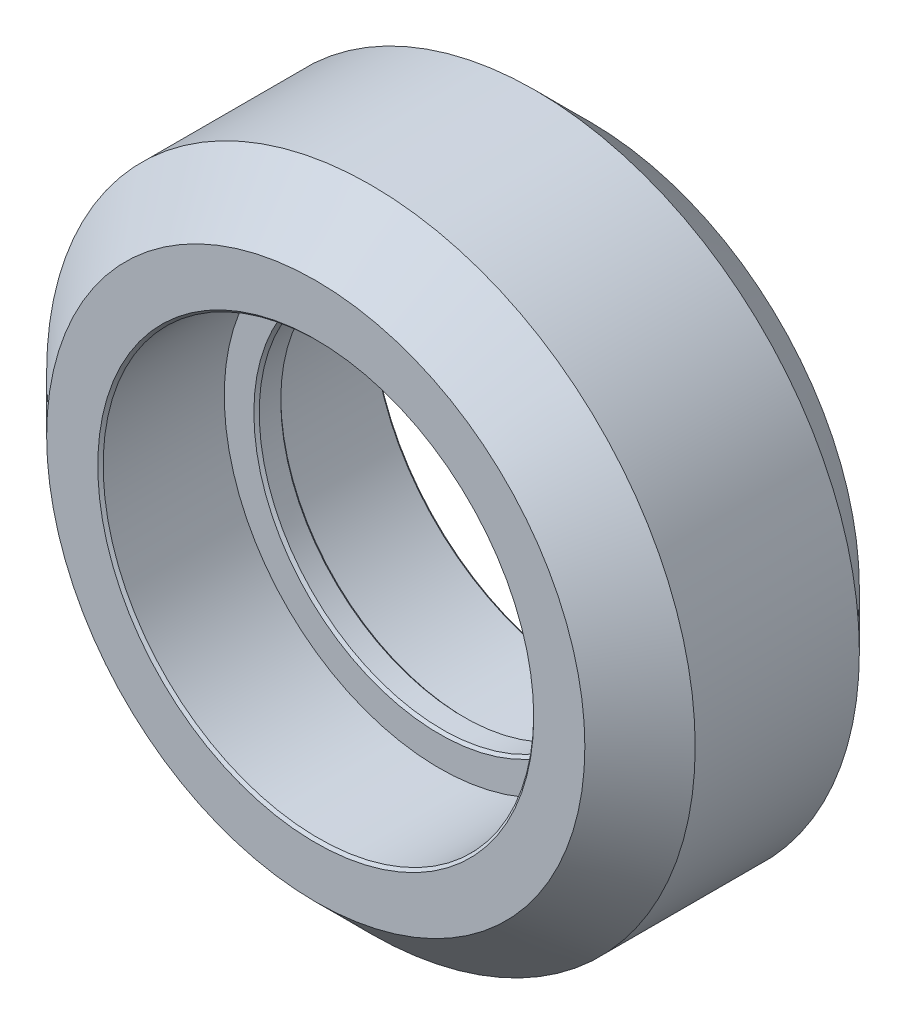
ISO-10303-21;
HEADER;
FILE_DESCRIPTION(('STEP AP214'),'2;1');
FILE_NAME('part.step','',(''),(''),'','','');
FILE_SCHEMA(('AUTOMOTIVE_DESIGN { 1 0 10303 214 1 1 1 1 }'));
ENDSEC;
DATA;
#1=APPLICATION_CONTEXT('core data for automotive mechanical design processes');
#2=APPLICATION_PROTOCOL_DEFINITION('international standard','automotive_design',2000,#1);
#3=PRODUCT_CONTEXT('',#1,'mechanical');
#4=PRODUCT('Part','Part','',(#3));
#5=PRODUCT_RELATED_PRODUCT_CATEGORY('part','',(#4));
#6=PRODUCT_DEFINITION_FORMATION('','',#4);
#7=PRODUCT_DEFINITION_CONTEXT('part definition',#1,'design');
#8=PRODUCT_DEFINITION('design','',#6,#7);
#9=PRODUCT_DEFINITION_SHAPE('','',#8);
#10=(LENGTH_UNIT() NAMED_UNIT(*) SI_UNIT(.MILLI.,.METRE.));
#11=(NAMED_UNIT(*) PLANE_ANGLE_UNIT() SI_UNIT($,.RADIAN.));
#12=(NAMED_UNIT(*) SI_UNIT($,.STERADIAN.) SOLID_ANGLE_UNIT());
#13=UNCERTAINTY_MEASURE_WITH_UNIT(LENGTH_MEASURE(1.E-05),#10,'distance_accuracy_value','');
#14=(GEOMETRIC_REPRESENTATION_CONTEXT(3) GLOBAL_UNCERTAINTY_ASSIGNED_CONTEXT((#13)) GLOBAL_UNIT_ASSIGNED_CONTEXT((#10,
#11,#12)) REPRESENTATION_CONTEXT('',''));
#15=CARTESIAN_POINT('',(0.,0.,0.));
#16=DIRECTION('',(0.,0.,1.));
#17=DIRECTION('',(1.,0.,0.));
#18=AXIS2_PLACEMENT_3D('',#15,#16,#17);
#19=CARTESIAN_POINT('',(15.5,-35.5,-38.35));
#20=DIRECTION('',(0.,0.,1.));
#21=DIRECTION('',(1.,0.,0.));
#22=AXIS2_PLACEMENT_3D('',#19,#20,#21);
#23=CYLINDRICAL_SURFACE('',#22,6.8);
#24=CARTESIAN_POINT('',(15.5,-35.5,-13.8499999999908));
#25=DIRECTION('',(0.,0.,-1.));
#26=DIRECTION('',(-1.,0.,0.));
#27=AXIS2_PLACEMENT_3D('',#24,#25,#26);
#28=CIRCLE('',#27,6.79999999991014);
#29=CARTESIAN_POINT('',(8.70000000008986,-35.5,-13.8499999999908));
#30=VERTEX_POINT('',#29);
#31=EDGE_CURVE('E40',#30,#30,#28,.T.);
#32=ORIENTED_EDGE('',*,*,#31,.T.);
#33=EDGE_LOOP('',(#32));
#34=FACE_BOUND('',#33,.T.);
#35=CARTESIAN_POINT('',(15.5,-35.5,-13.0500000000211));
#36=DIRECTION('',(0.,0.,1.));
#37=DIRECTION('',(1.,0.,0.));
#38=AXIS2_PLACEMENT_3D('',#35,#36,#37);
#39=CIRCLE('',#38,6.7999999999729);
#40=CARTESIAN_POINT('',(22.2999999999729,-35.5,-13.0500000000211));
#41=VERTEX_POINT('',#40);
#42=EDGE_CURVE('E37',#41,#41,#39,.T.);
#43=ORIENTED_EDGE('',*,*,#42,.T.);
#44=EDGE_LOOP('',(#43));
#45=FACE_BOUND('',#44,.T.);
#46=ADVANCED_FACE('F14',(#34,#45),#23,.F.);
#47=CARTESIAN_POINT('',(15.5,-35.5,-13.9499999999089));
#48=DIRECTION('',(0.,0.,-1.));
#49=DIRECTION('',(-1.,0.,0.));
#50=AXIS2_PLACEMENT_3D('',#47,#48,#49);
#51=CONICAL_SURFACE('',#50,6.8999999998282,0.785398163397448);
#52=ORIENTED_EDGE('',*,*,#31,.F.);
#53=EDGE_LOOP('',(#52));
#54=FACE_BOUND('',#53,.T.);
#55=CARTESIAN_POINT('',(15.5,-35.5,-13.9500000000226));
#56=DIRECTION('',(0.,0.,-1.));
#57=DIRECTION('',(-1.,0.,0.));
#58=AXIS2_PLACEMENT_3D('',#55,#56,#57);
#59=CIRCLE('',#58,6.89999999994188);
#60=CARTESIAN_POINT('',(8.60000000005812,-35.5,-13.9500000000226));
#61=VERTEX_POINT('',#60);
#62=EDGE_CURVE('E17',#61,#61,#59,.F.);
#63=ORIENTED_EDGE('',*,*,#62,.F.);
#64=EDGE_LOOP('',(#63));
#65=FACE_BOUND('',#64,.T.);
#66=ADVANCED_FACE('F66',(#54,#65),#51,.F.);
#67=CARTESIAN_POINT('',(15.5,-35.5,-12.950000000103));
#68=DIRECTION('',(0.,0.,1.));
#69=DIRECTION('',(1.,0.,0.));
#70=AXIS2_PLACEMENT_3D('',#67,#68,#69);
#71=CONICAL_SURFACE('',#70,6.89999999989095,0.785398163397448);
#72=ORIENTED_EDGE('',*,*,#42,.F.);
#73=EDGE_LOOP('',(#72));
#74=FACE_BOUND('',#73,.T.);
#75=CARTESIAN_POINT('',(15.5,-35.5,-12.9499999999894));
#76=DIRECTION('',(0.,0.,1.));
#77=DIRECTION('',(1.,0.,0.));
#78=AXIS2_PLACEMENT_3D('',#75,#76,#77);
#79=CIRCLE('',#78,6.90000000000464);
#80=CARTESIAN_POINT('',(22.4000000000046,-35.5,-12.9499999999894));
#81=VERTEX_POINT('',#80);
#82=EDGE_CURVE('E57',#81,#81,#79,.F.);
#83=ORIENTED_EDGE('',*,*,#82,.F.);
#84=EDGE_LOOP('',(#83));
#85=FACE_BOUND('',#84,.T.);
#86=ADVANCED_FACE('F68',(#74,#85),#71,.F.);
#87=CARTESIAN_POINT('',(15.5,-35.5,-13.95));
#88=DIRECTION('',(0.,0.,-1.));
#89=DIRECTION('',(-1.,0.,0.));
#90=AXIS2_PLACEMENT_3D('',#87,#88,#89);
#91=PLANE('',#90);
#92=CARTESIAN_POINT('',(15.5,-35.5,-13.95));
#93=DIRECTION('',(0.,0.,-1.));
#94=DIRECTION('',(-1.,0.,0.));
#95=AXIS2_PLACEMENT_3D('',#92,#93,#94);
#96=CIRCLE('',#95,8.);
#97=CARTESIAN_POINT('',(7.5,-35.5,-13.95));
#98=VERTEX_POINT('',#97);
#99=EDGE_CURVE('E55',#98,#98,#96,.T.);
#100=ORIENTED_EDGE('',*,*,#99,.T.);
#101=EDGE_LOOP('',(#100));
#102=FACE_BOUND('',#101,.T.);
#103=ORIENTED_EDGE('',*,*,#62,.T.);
#104=EDGE_LOOP('',(#103));
#105=FACE_BOUND('',#104,.T.);
#106=ADVANCED_FACE('F64',(#102,#105),#91,.T.);
#107=CARTESIAN_POINT('',(15.5,-35.5,-12.95));
#108=DIRECTION('',(0.,0.,1.));
#109=DIRECTION('',(1.,0.,0.));
#110=AXIS2_PLACEMENT_3D('',#107,#108,#109);
#111=PLANE('',#110);
#112=CARTESIAN_POINT('',(15.5,-35.5,-12.95));
#113=DIRECTION('',(0.,0.,1.));
#114=DIRECTION('',(1.,0.,0.));
#115=AXIS2_PLACEMENT_3D('',#112,#113,#114);
#116=CIRCLE('',#115,8.);
#117=CARTESIAN_POINT('',(23.5,-35.5,-12.95));
#118=VERTEX_POINT('',#117);
#119=EDGE_CURVE('E36',#118,#118,#116,.T.);
#120=ORIENTED_EDGE('',*,*,#119,.T.);
#121=EDGE_LOOP('',(#120));
#122=FACE_BOUND('',#121,.T.);
#123=ORIENTED_EDGE('',*,*,#82,.T.);
#124=EDGE_LOOP('',(#123));
#125=FACE_BOUND('',#124,.T.);
#126=ADVANCED_FACE('F117',(#122,#125),#111,.T.);
#127=CARTESIAN_POINT('',(15.5,-35.5,-13.95));
#128=DIRECTION('',(0.,0.,-1.));
#129=DIRECTION('',(-1.,0.,0.));
#130=AXIS2_PLACEMENT_3D('',#127,#128,#129);
#131=CYLINDRICAL_SURFACE('',#130,8.);
#132=CARTESIAN_POINT('',(15.5,-35.5,-18.45));
#133=DIRECTION('',(0.,0.,-1.));
#134=DIRECTION('',(-1.,0.,0.));
#135=AXIS2_PLACEMENT_3D('',#132,#133,#134);
#136=CIRCLE('',#135,8.);
#137=CARTESIAN_POINT('',(7.5,-35.5,-18.45));
#138=VERTEX_POINT('',#137);
#139=EDGE_CURVE('E33',#138,#138,#136,.T.);
#140=ORIENTED_EDGE('',*,*,#139,.T.);
#141=EDGE_LOOP('',(#140));
#142=FACE_BOUND('',#141,.T.);
#143=ORIENTED_EDGE('',*,*,#99,.F.);
#144=EDGE_LOOP('',(#143));
#145=FACE_BOUND('',#144,.T.);
#146=ADVANCED_FACE('F113',(#142,#145),#131,.F.);
#147=CARTESIAN_POINT('',(15.5,-35.5,-12.95));
#148=DIRECTION('',(0.,0.,1.));
#149=DIRECTION('',(1.,0.,0.));
#150=AXIS2_PLACEMENT_3D('',#147,#148,#149);
#151=CYLINDRICAL_SURFACE('',#150,8.);
#152=ORIENTED_EDGE('',*,*,#119,.F.);
#153=EDGE_LOOP('',(#152));
#154=FACE_BOUND('',#153,.T.);
#155=CARTESIAN_POINT('',(15.5,-35.5,-8.45));
#156=DIRECTION('',(0.,0.,1.));
#157=DIRECTION('',(1.,0.,0.));
#158=AXIS2_PLACEMENT_3D('',#155,#156,#157);
#159=CIRCLE('',#158,8.);
#160=CARTESIAN_POINT('',(23.5,-35.5,-8.45));
#161=VERTEX_POINT('',#160);
#162=EDGE_CURVE('E29',#161,#161,#159,.T.);
#163=ORIENTED_EDGE('',*,*,#162,.T.);
#164=EDGE_LOOP('',(#163));
#165=FACE_BOUND('',#164,.T.);
#166=ADVANCED_FACE('F109',(#154,#165),#151,.F.);
#167=CARTESIAN_POINT('',(15.5,-35.5,-18.55));
#168=DIRECTION('',(0.,0.,-1.));
#169=DIRECTION('',(-1.,0.,0.));
#170=AXIS2_PLACEMENT_3D('',#167,#168,#169);
#171=CONICAL_SURFACE('',#170,8.1,0.785398163397448);
#172=CARTESIAN_POINT('',(15.5,-35.5,-18.55));
#173=DIRECTION('',(0.,0.,-1.));
#174=DIRECTION('',(-1.,0.,0.));
#175=AXIS2_PLACEMENT_3D('',#172,#173,#174);
#176=CIRCLE('',#175,8.1);
#177=CARTESIAN_POINT('',(7.4,-35.5,-18.55));
#178=VERTEX_POINT('',#177);
#179=EDGE_CURVE('E32',#178,#178,#176,.T.);
#180=ORIENTED_EDGE('',*,*,#179,.T.);
#181=EDGE_LOOP('',(#180));
#182=FACE_BOUND('',#181,.T.);
#183=ORIENTED_EDGE('',*,*,#139,.F.);
#184=EDGE_LOOP('',(#183));
#185=FACE_BOUND('',#184,.T.);
#186=ADVANCED_FACE('F105',(#182,#185),#171,.F.);
#187=CARTESIAN_POINT('',(15.5,-35.5,-8.35));
#188=DIRECTION('',(0.,0.,1.));
#189=DIRECTION('',(1.,0.,0.));
#190=AXIS2_PLACEMENT_3D('',#187,#188,#189);
#191=CONICAL_SURFACE('',#190,8.1,0.785398163397448);
#192=ORIENTED_EDGE('',*,*,#162,.F.);
#193=EDGE_LOOP('',(#192));
#194=FACE_BOUND('',#193,.T.);
#195=CARTESIAN_POINT('',(15.5,-35.5,-8.35));
#196=DIRECTION('',(0.,0.,1.));
#197=DIRECTION('',(1.,0.,0.));
#198=AXIS2_PLACEMENT_3D('',#195,#196,#197);
#199=CIRCLE('',#198,8.1);
#200=CARTESIAN_POINT('',(23.6,-35.5,-8.35));
#201=VERTEX_POINT('',#200);
#202=EDGE_CURVE('E48',#201,#201,#199,.F.);
#203=ORIENTED_EDGE('',*,*,#202,.F.);
#204=EDGE_LOOP('',(#203));
#205=FACE_BOUND('',#204,.T.);
#206=ADVANCED_FACE('F101',(#194,#205),#191,.F.);
#207=CARTESIAN_POINT('',(15.5,-35.5,-18.55));
#208=DIRECTION('',(0.,0.,1.));
#209=DIRECTION('',(1.,0.,0.));
#210=AXIS2_PLACEMENT_3D('',#207,#208,#209);
#211=PLANE('',#210);
#212=CARTESIAN_POINT('',(15.5,-35.5,-18.55));
#213=DIRECTION('',(0.,0.,1.));
#214=DIRECTION('',(1.,0.,0.));
#215=AXIS2_PLACEMENT_3D('',#212,#213,#214);
#216=CIRCLE('',#215,10.);
#217=CARTESIAN_POINT('',(25.5,-35.5,-18.55));
#218=VERTEX_POINT('',#217);
#219=EDGE_CURVE('E45',#218,#218,#216,.T.);
#220=ORIENTED_EDGE('',*,*,#219,.F.);
#221=EDGE_LOOP('',(#220));
#222=FACE_BOUND('',#221,.T.);
#223=ORIENTED_EDGE('',*,*,#179,.F.);
#224=EDGE_LOOP('',(#223));
#225=FACE_BOUND('',#224,.T.);
#226=ADVANCED_FACE('F97',(#222,#225),#211,.F.);
#227=CARTESIAN_POINT('',(15.5,-35.5,-8.35));
#228=DIRECTION('',(0.,0.,1.));
#229=DIRECTION('',(1.,0.,0.));
#230=AXIS2_PLACEMENT_3D('',#227,#228,#229);
#231=PLANE('',#230);
#232=CARTESIAN_POINT('',(15.5,-35.5,-8.35));
#233=DIRECTION('',(0.,0.,-1.));
#234=DIRECTION('',(-1.,0.,0.));
#235=AXIS2_PLACEMENT_3D('',#232,#233,#234);
#236=CIRCLE('',#235,10.);
#237=CARTESIAN_POINT('',(5.5,-35.5,-8.35));
#238=VERTEX_POINT('',#237);
#239=EDGE_CURVE('E26',#238,#238,#236,.T.);
#240=ORIENTED_EDGE('',*,*,#239,.F.);
#241=EDGE_LOOP('',(#240));
#242=FACE_BOUND('',#241,.T.);
#243=ORIENTED_EDGE('',*,*,#202,.T.);
#244=EDGE_LOOP('',(#243));
#245=FACE_BOUND('',#244,.T.);
#246=ADVANCED_FACE('F93',(#242,#245),#231,.T.);
#247=CARTESIAN_POINT('',(15.5,-35.5,-16.5));
#248=DIRECTION('',(0.,0.,1.));
#249=DIRECTION('',(1.,0.,0.));
#250=AXIS2_PLACEMENT_3D('',#247,#248,#249);
#251=CONICAL_SURFACE('',#250,12.05,0.785398163397448);
#252=CARTESIAN_POINT('',(15.5,-35.5,-16.5));
#253=DIRECTION('',(0.,0.,1.));
#254=DIRECTION('',(1.,0.,0.));
#255=AXIS2_PLACEMENT_3D('',#252,#253,#254);
#256=CIRCLE('',#255,12.05);
#257=CARTESIAN_POINT('',(27.55,-35.5,-16.5));
#258=VERTEX_POINT('',#257);
#259=EDGE_CURVE('E21',#258,#258,#256,.T.);
#260=ORIENTED_EDGE('',*,*,#259,.F.);
#261=EDGE_LOOP('',(#260));
#262=FACE_BOUND('',#261,.T.);
#263=ORIENTED_EDGE('',*,*,#219,.T.);
#264=EDGE_LOOP('',(#263));
#265=FACE_BOUND('',#264,.T.);
#266=ADVANCED_FACE('F86',(#262,#265),#251,.T.);
#267=CARTESIAN_POINT('',(15.5,-35.5,-10.4));
#268=DIRECTION('',(0.,0.,-1.));
#269=DIRECTION('',(-1.,0.,0.));
#270=AXIS2_PLACEMENT_3D('',#267,#268,#269);
#271=CONICAL_SURFACE('',#270,12.05,0.785398163397448);
#272=CARTESIAN_POINT('',(15.5,-35.5,-10.4));
#273=DIRECTION('',(0.,0.,1.));
#274=DIRECTION('',(1.,0.,0.));
#275=AXIS2_PLACEMENT_3D('',#272,#273,#274);
#276=CIRCLE('',#275,12.05);
#277=CARTESIAN_POINT('',(27.55,-35.5,-10.4));
#278=VERTEX_POINT('',#277);
#279=EDGE_CURVE('E10',#278,#278,#276,.F.);
#280=ORIENTED_EDGE('',*,*,#279,.F.);
#281=EDGE_LOOP('',(#280));
#282=FACE_BOUND('',#281,.T.);
#283=ORIENTED_EDGE('',*,*,#239,.T.);
#284=EDGE_LOOP('',(#283));
#285=FACE_BOUND('',#284,.T.);
#286=ADVANCED_FACE('F81',(#282,#285),#271,.T.);
#287=CARTESIAN_POINT('',(15.5,-35.5,-16.));
#288=DIRECTION('',(0.,0.,1.));
#289=DIRECTION('',(1.,0.,0.));
#290=AXIS2_PLACEMENT_3D('',#287,#288,#289);
#291=CYLINDRICAL_SURFACE('',#290,12.05);
#292=ORIENTED_EDGE('',*,*,#279,.T.);
#293=EDGE_LOOP('',(#292));
#294=FACE_BOUND('',#293,.T.);
#295=ORIENTED_EDGE('',*,*,#259,.T.);
#296=EDGE_LOOP('',(#295));
#297=FACE_BOUND('',#296,.T.);
#298=ADVANCED_FACE('F79',(#294,#297),#291,.T.);
#299=CLOSED_SHELL('',(#46,#66,#86,#106,#126,#146,#166,#186,#206,#226,#246,#266,#286,#298));
#300=MANIFOLD_SOLID_BREP('B1',#299);
#301=ADVANCED_BREP_SHAPE_REPRESENTATION('',(#18,#300),#14);
#302=SHAPE_DEFINITION_REPRESENTATION(#9,#301);
ENDSEC;
END-ISO-10303-21;
